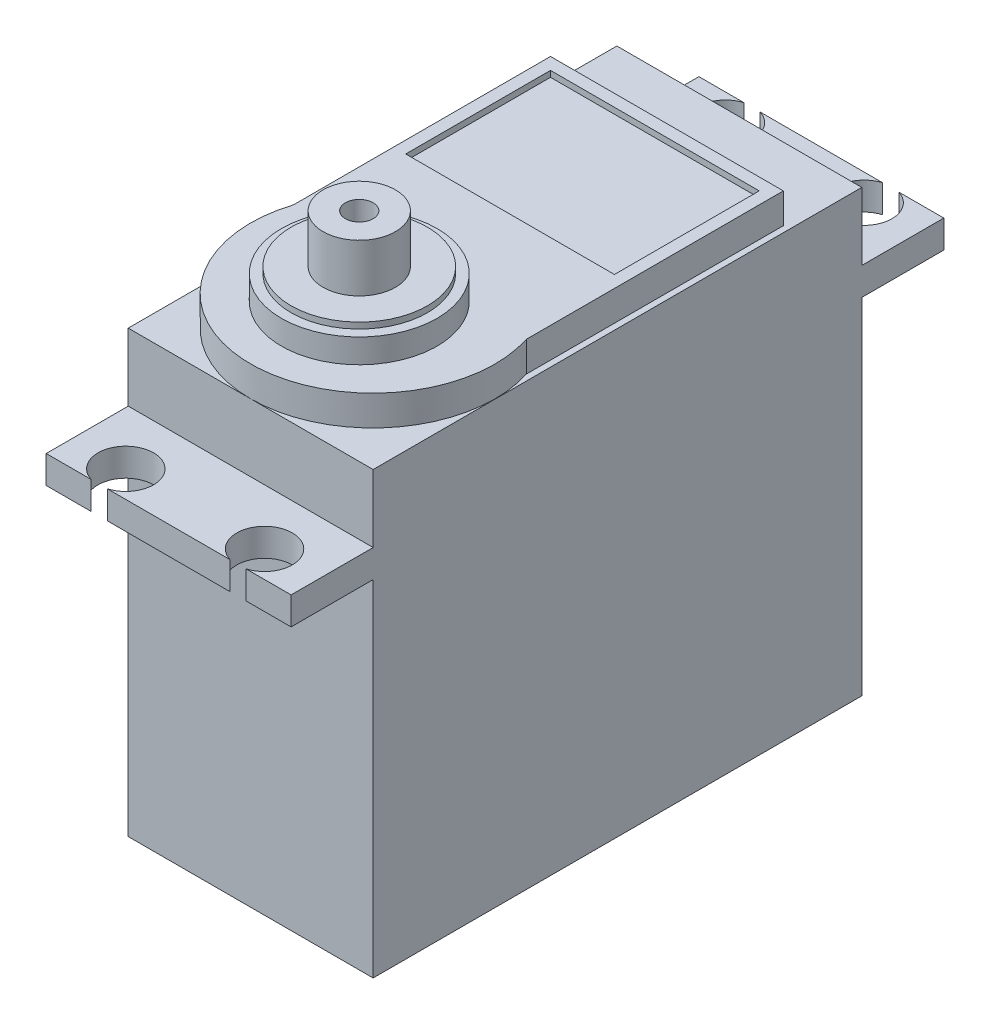
ISO-10303-21;
HEADER;
FILE_DESCRIPTION(('STEP AP214'),'2;1');
FILE_NAME('part.step','',(''),(''),'','','');
FILE_SCHEMA(('AUTOMOTIVE_DESIGN { 1 0 10303 214 1 1 1 1 }'));
ENDSEC;
DATA;
#1=APPLICATION_CONTEXT('core data for automotive mechanical design processes');
#2=APPLICATION_PROTOCOL_DEFINITION('international standard','automotive_design',2000,#1);
#3=PRODUCT_CONTEXT('',#1,'mechanical');
#4=PRODUCT('Part','Part','',(#3));
#5=PRODUCT_RELATED_PRODUCT_CATEGORY('part','',(#4));
#6=PRODUCT_DEFINITION_FORMATION('','',#4);
#7=PRODUCT_DEFINITION_CONTEXT('part definition',#1,'design');
#8=PRODUCT_DEFINITION('design','',#6,#7);
#9=PRODUCT_DEFINITION_SHAPE('','',#8);
#10=(LENGTH_UNIT() NAMED_UNIT(*) SI_UNIT(.MILLI.,.METRE.));
#11=(NAMED_UNIT(*) PLANE_ANGLE_UNIT() SI_UNIT($,.RADIAN.));
#12=(NAMED_UNIT(*) SI_UNIT($,.STERADIAN.) SOLID_ANGLE_UNIT());
#13=UNCERTAINTY_MEASURE_WITH_UNIT(LENGTH_MEASURE(1.E-05),#10,'distance_accuracy_value','');
#14=(GEOMETRIC_REPRESENTATION_CONTEXT(3) GLOBAL_UNCERTAINTY_ASSIGNED_CONTEXT((#13)) GLOBAL_UNIT_ASSIGNED_CONTEXT((#10,
#11,#12)) REPRESENTATION_CONTEXT('',''));
#15=CARTESIAN_POINT('',(0.,0.,0.));
#16=DIRECTION('',(0.,0.,1.));
#17=DIRECTION('',(1.,0.,0.));
#18=AXIS2_PLACEMENT_3D('',#15,#16,#17);
#19=CARTESIAN_POINT('',(-10.15,30.9,-27.05));
#20=DIRECTION('',(0.,-1.,0.));
#21=DIRECTION('',(0.,0.,-1.));
#22=AXIS2_PLACEMENT_3D('',#19,#20,#21);
#23=PLANE('',#22);
#24=DIRECTION('',(1.,0.,0.));
#25=VECTOR('',#24,1.);
#26=CARTESIAN_POINT('',(-10.15,30.9,-27.05));
#27=LINE('',#26,#25);
#28=CARTESIAN_POINT('',(-5.07917960675002,30.9,-27.05));
#29=VERTEX_POINT('',#28);
#30=CARTESIAN_POINT('',(5.07917960675007,30.9,-27.05));
#31=VERTEX_POINT('',#30);
#32=EDGE_CURVE('E348',#29,#31,#27,.T.);
#33=ORIENTED_EDGE('',*,*,#32,.F.);
#34=CARTESIAN_POINT('',(-5.74999999999999,30.9,-24.85));
#35=DIRECTION('',(0.,-1.,0.));
#36=DIRECTION('',(0.,0.,-1.));
#37=AXIS2_PLACEMENT_3D('',#34,#35,#36);
#38=CIRCLE('',#37,2.3);
#39=CARTESIAN_POINT('',(-6.42082039324996,30.9,-27.05));
#40=VERTEX_POINT('',#39);
#41=EDGE_CURVE('E312',#40,#29,#38,.F.);
#42=ORIENTED_EDGE('',*,*,#41,.F.);
#43=CARTESIAN_POINT('',(-10.15,30.9,-27.05));
#44=VERTEX_POINT('',#43);
#45=EDGE_CURVE('E344',#44,#40,#27,.T.);
#46=ORIENTED_EDGE('',*,*,#45,.F.);
#47=DIRECTION('',(0.,0.,1.));
#48=VECTOR('',#47,1.);
#49=CARTESIAN_POINT('',(-10.15,30.9,-27.05));
#50=LINE('',#49,#48);
#51=CARTESIAN_POINT('',(-10.15,30.9,-20.25));
#52=VERTEX_POINT('',#51);
#53=EDGE_CURVE('E353',#44,#52,#50,.T.);
#54=ORIENTED_EDGE('',*,*,#53,.T.);
#55=DIRECTION('',(1.,0.,0.));
#56=VECTOR('',#55,1.);
#57=CARTESIAN_POINT('',(-10.15,30.9,-20.25));
#58=LINE('',#57,#56);
#59=CARTESIAN_POINT('',(10.15,30.9,-20.25));
#60=VERTEX_POINT('',#59);
#61=EDGE_CURVE('E336',#52,#60,#58,.T.);
#62=ORIENTED_EDGE('',*,*,#61,.T.);
#63=DIRECTION('',(0.,0.,1.));
#64=VECTOR('',#63,1.);
#65=CARTESIAN_POINT('',(10.15,30.9,-27.05));
#66=LINE('',#65,#64);
#67=CARTESIAN_POINT('',(10.15,30.9,-27.05));
#68=VERTEX_POINT('',#67);
#69=EDGE_CURVE('E357',#68,#60,#66,.T.);
#70=ORIENTED_EDGE('',*,*,#69,.F.);
#71=CARTESIAN_POINT('',(6.42082039324993,30.9,-27.05));
#72=VERTEX_POINT('',#71);
#73=EDGE_CURVE('E343',#72,#68,#27,.T.);
#74=ORIENTED_EDGE('',*,*,#73,.F.);
#75=CARTESIAN_POINT('',(5.75,30.9,-24.85));
#76=DIRECTION('',(0.,-1.,0.));
#77=DIRECTION('',(0.,0.,-1.));
#78=AXIS2_PLACEMENT_3D('',#75,#76,#77);
#79=CIRCLE('',#78,2.3);
#80=EDGE_CURVE('E319',#72,#31,#79,.T.);
#81=ORIENTED_EDGE('',*,*,#80,.T.);
#82=EDGE_LOOP('',(#33,#42,#46,#54,#62,#70,#74,#81));
#83=FACE_BOUND('',#82,.T.);
#84=ADVANCED_FACE('F35',(#83),#23,.F.);
#85=CARTESIAN_POINT('',(10.15,28.6,-27.05));
#86=DIRECTION('',(0.,1.,0.));
#87=DIRECTION('',(0.,0.,1.));
#88=AXIS2_PLACEMENT_3D('',#85,#86,#87);
#89=PLANE('',#88);
#90=DIRECTION('',(-1.,0.,0.));
#91=VECTOR('',#90,1.);
#92=CARTESIAN_POINT('',(10.15,28.6,-27.05));
#93=LINE('',#92,#91);
#94=CARTESIAN_POINT('',(-6.42082039324996,28.6,-27.05));
#95=VERTEX_POINT('',#94);
#96=CARTESIAN_POINT('',(-10.15,28.6,-27.05));
#97=VERTEX_POINT('',#96);
#98=EDGE_CURVE('E335',#95,#97,#93,.T.);
#99=ORIENTED_EDGE('',*,*,#98,.F.);
#100=CARTESIAN_POINT('',(-5.74999999999999,28.6,-24.85));
#101=DIRECTION('',(0.,1.,0.));
#102=DIRECTION('',(0.,0.,1.));
#103=AXIS2_PLACEMENT_3D('',#100,#101,#102);
#104=CIRCLE('',#103,2.3);
#105=CARTESIAN_POINT('',(-5.07917960675002,28.6,-27.05));
#106=VERTEX_POINT('',#105);
#107=EDGE_CURVE('E316',#106,#95,#104,.F.);
#108=ORIENTED_EDGE('',*,*,#107,.F.);
#109=CARTESIAN_POINT('',(5.07917960675007,28.6,-27.05));
#110=VERTEX_POINT('',#109);
#111=EDGE_CURVE('E341',#110,#106,#93,.T.);
#112=ORIENTED_EDGE('',*,*,#111,.F.);
#113=CARTESIAN_POINT('',(5.75,28.6,-24.85));
#114=DIRECTION('',(0.,1.,0.));
#115=DIRECTION('',(0.,0.,1.));
#116=AXIS2_PLACEMENT_3D('',#113,#114,#115);
#117=CIRCLE('',#116,2.3);
#118=CARTESIAN_POINT('',(6.42082039324993,28.6,-27.05));
#119=VERTEX_POINT('',#118);
#120=EDGE_CURVE('E304',#110,#119,#117,.T.);
#121=ORIENTED_EDGE('',*,*,#120,.T.);
#122=CARTESIAN_POINT('',(10.15,28.6,-27.05));
#123=VERTEX_POINT('',#122);
#124=EDGE_CURVE('E337',#123,#119,#93,.T.);
#125=ORIENTED_EDGE('',*,*,#124,.F.);
#126=DIRECTION('',(0.,0.,1.));
#127=VECTOR('',#126,1.);
#128=CARTESIAN_POINT('',(10.15,28.6,-27.05));
#129=LINE('',#128,#127);
#130=CARTESIAN_POINT('',(10.15,28.6,-20.25));
#131=VERTEX_POINT('',#130);
#132=EDGE_CURVE('E360',#123,#131,#129,.T.);
#133=ORIENTED_EDGE('',*,*,#132,.T.);
#134=DIRECTION('',(-1.,0.,0.));
#135=VECTOR('',#134,1.);
#136=CARTESIAN_POINT('',(10.15,28.6,-20.25));
#137=LINE('',#136,#135);
#138=CARTESIAN_POINT('',(-10.15,28.6,-20.25));
#139=VERTEX_POINT('',#138);
#140=EDGE_CURVE('E314',#131,#139,#137,.T.);
#141=ORIENTED_EDGE('',*,*,#140,.T.);
#142=DIRECTION('',(0.,0.,1.));
#143=VECTOR('',#142,1.);
#144=CARTESIAN_POINT('',(-10.15,28.6,-27.05));
#145=LINE('',#144,#143);
#146=EDGE_CURVE('E347',#97,#139,#145,.T.);
#147=ORIENTED_EDGE('',*,*,#146,.F.);
#148=EDGE_LOOP('',(#99,#108,#112,#121,#125,#133,#141,#147));
#149=FACE_BOUND('',#148,.T.);
#150=ADVANCED_FACE('F475',(#149),#89,.F.);
#151=CARTESIAN_POINT('',(0.,0.,-27.05));
#152=DIRECTION('',(0.,0.,1.));
#153=DIRECTION('',(-1.,0.,0.));
#154=AXIS2_PLACEMENT_3D('',#151,#152,#153);
#155=PLANE('',#154);
#156=ORIENTED_EDGE('',*,*,#111,.T.);
#157=DIRECTION('',(0.,1.,0.));
#158=VECTOR('',#157,1.);
#159=CARTESIAN_POINT('',(-5.07917960675002,-0.00199999999999853,-27.05));
#160=LINE('',#159,#158);
#161=EDGE_CURVE('E318',#106,#29,#160,.T.);
#162=ORIENTED_EDGE('',*,*,#161,.T.);
#163=ORIENTED_EDGE('',*,*,#32,.T.);
#164=DIRECTION('',(0.,1.,0.));
#165=VECTOR('',#164,1.);
#166=CARTESIAN_POINT('',(5.07917960675007,-0.00199999999999853,-27.05));
#167=LINE('',#166,#165);
#168=EDGE_CURVE('E328',#110,#31,#167,.T.);
#169=ORIENTED_EDGE('',*,*,#168,.F.);
#170=EDGE_LOOP('',(#156,#162,#163,#169));
#171=FACE_BOUND('',#170,.T.);
#172=ADVANCED_FACE('F540',(#171),#155,.F.);
#173=DIRECTION('',(0.,1.,0.));
#174=VECTOR('',#173,1.);
#175=CARTESIAN_POINT('',(6.42082039324993,-0.00199999999999853,-27.05));
#176=LINE('',#175,#174);
#177=EDGE_CURVE('E325',#119,#72,#176,.T.);
#178=ORIENTED_EDGE('',*,*,#177,.T.);
#179=ORIENTED_EDGE('',*,*,#73,.T.);
#180=DIRECTION('',(0.,-1.,0.));
#181=VECTOR('',#180,1.);
#182=CARTESIAN_POINT('',(10.15,30.9,-27.05));
#183=LINE('',#182,#181);
#184=EDGE_CURVE('E340',#68,#123,#183,.T.);
#185=ORIENTED_EDGE('',*,*,#184,.T.);
#186=ORIENTED_EDGE('',*,*,#124,.T.);
#187=EDGE_LOOP('',(#178,#179,#185,#186));
#188=FACE_BOUND('',#187,.T.);
#189=ADVANCED_FACE('F480',(#188),#155,.F.);
#190=ORIENTED_EDGE('',*,*,#45,.T.);
#191=DIRECTION('',(0.,1.,0.));
#192=VECTOR('',#191,1.);
#193=CARTESIAN_POINT('',(-6.42082039324996,-0.00199999999999853,-27.05));
#194=LINE('',#193,#192);
#195=EDGE_CURVE('E315',#95,#40,#194,.T.);
#196=ORIENTED_EDGE('',*,*,#195,.F.);
#197=ORIENTED_EDGE('',*,*,#98,.T.);
#198=DIRECTION('',(0.,1.,0.));
#199=VECTOR('',#198,1.);
#200=CARTESIAN_POINT('',(-10.15,28.6,-27.05));
#201=LINE('',#200,#199);
#202=EDGE_CURVE('E332',#97,#44,#201,.T.);
#203=ORIENTED_EDGE('',*,*,#202,.T.);
#204=EDGE_LOOP('',(#190,#196,#197,#203));
#205=FACE_BOUND('',#204,.T.);
#206=ADVANCED_FACE('F800',(#205),#155,.F.);
#207=CARTESIAN_POINT('',(-10.15,36.5,-20.25));
#208=DIRECTION('',(0.,0.,1.));
#209=DIRECTION('',(1.,0.,0.));
#210=AXIS2_PLACEMENT_3D('',#207,#208,#209);
#211=PLANE('',#210);
#212=ORIENTED_EDGE('',*,*,#140,.F.);
#213=DIRECTION('',(0.,-1.,0.));
#214=VECTOR('',#213,1.);
#215=CARTESIAN_POINT('',(10.15,36.5,-20.25));
#216=LINE('',#215,#214);
#217=CARTESIAN_POINT('',(10.15,0.,-20.25));
#218=VERTEX_POINT('',#217);
#219=EDGE_CURVE('E448',#131,#218,#216,.T.);
#220=ORIENTED_EDGE('',*,*,#219,.T.);
#221=DIRECTION('',(-1.,0.,0.));
#222=VECTOR('',#221,1.);
#223=CARTESIAN_POINT('',(-10.15,0.,-20.25));
#224=LINE('',#223,#222);
#225=CARTESIAN_POINT('',(-10.15,0.,-20.25));
#226=VERTEX_POINT('',#225);
#227=EDGE_CURVE('E430',#218,#226,#224,.T.);
#228=ORIENTED_EDGE('',*,*,#227,.T.);
#229=DIRECTION('',(0.,-1.,0.));
#230=VECTOR('',#229,1.);
#231=CARTESIAN_POINT('',(-10.15,36.5,-20.25));
#232=LINE('',#231,#230);
#233=EDGE_CURVE('E445',#139,#226,#232,.T.);
#234=ORIENTED_EDGE('',*,*,#233,.F.);
#235=EDGE_LOOP('',(#212,#220,#228,#234));
#236=FACE_BOUND('',#235,.T.);
#237=ADVANCED_FACE('F455',(#236),#211,.F.);
#238=ORIENTED_EDGE('',*,*,#61,.F.);
#239=CARTESIAN_POINT('',(-10.15,36.5,-20.25));
#240=VERTEX_POINT('',#239);
#241=EDGE_CURVE('E446',#240,#52,#232,.T.);
#242=ORIENTED_EDGE('',*,*,#241,.F.);
#243=DIRECTION('',(-1.,0.,0.));
#244=VECTOR('',#243,1.);
#245=CARTESIAN_POINT('',(-10.15,36.5,-20.25));
#246=LINE('',#245,#244);
#247=CARTESIAN_POINT('',(10.15,36.5,-20.25));
#248=VERTEX_POINT('',#247);
#249=EDGE_CURVE('E418',#248,#240,#246,.T.);
#250=ORIENTED_EDGE('',*,*,#249,.F.);
#251=EDGE_CURVE('E449',#248,#60,#216,.T.);
#252=ORIENTED_EDGE('',*,*,#251,.T.);
#253=EDGE_LOOP('',(#238,#242,#250,#252));
#254=FACE_BOUND('',#253,.T.);
#255=ADVANCED_FACE('F486',(#254),#211,.F.);
#256=CARTESIAN_POINT('',(10.15,28.6,27.05));
#257=DIRECTION('',(0.,-1.,0.));
#258=DIRECTION('',(0.,0.,-1.));
#259=AXIS2_PLACEMENT_3D('',#256,#257,#258);
#260=PLANE('',#259);
#261=DIRECTION('',(-1.,0.,0.));
#262=VECTOR('',#261,1.);
#263=CARTESIAN_POINT('',(10.15,28.6,27.05));
#264=LINE('',#263,#262);
#265=CARTESIAN_POINT('',(5.07917960675007,28.6,27.05));
#266=VERTEX_POINT('',#265);
#267=CARTESIAN_POINT('',(-5.07917960675003,28.6,27.05));
#268=VERTEX_POINT('',#267);
#269=EDGE_CURVE('E402',#266,#268,#264,.T.);
#270=ORIENTED_EDGE('',*,*,#269,.T.);
#271=CARTESIAN_POINT('',(-5.74999999999999,28.6,24.85));
#272=DIRECTION('',(0.,-1.,0.));
#273=DIRECTION('',(0.,0.,-1.));
#274=AXIS2_PLACEMENT_3D('',#271,#272,#273);
#275=CIRCLE('',#274,2.3);
#276=CARTESIAN_POINT('',(-6.42082039324996,28.6,27.05));
#277=VERTEX_POINT('',#276);
#278=EDGE_CURVE('E370',#277,#268,#275,.T.);
#279=ORIENTED_EDGE('',*,*,#278,.F.);
#280=CARTESIAN_POINT('',(-10.15,28.6,27.05));
#281=VERTEX_POINT('',#280);
#282=EDGE_CURVE('E397',#277,#281,#264,.T.);
#283=ORIENTED_EDGE('',*,*,#282,.T.);
#284=DIRECTION('',(0.,0.,-1.));
#285=VECTOR('',#284,1.);
#286=CARTESIAN_POINT('',(-10.15,28.6,27.05));
#287=LINE('',#286,#285);
#288=CARTESIAN_POINT('',(-10.15,28.6,20.25));
#289=VERTEX_POINT('',#288);
#290=EDGE_CURVE('E407',#281,#289,#287,.T.);
#291=ORIENTED_EDGE('',*,*,#290,.T.);
#292=DIRECTION('',(-1.,0.,0.));
#293=VECTOR('',#292,1.);
#294=CARTESIAN_POINT('',(10.15,28.6,20.25));
#295=LINE('',#294,#293);
#296=CARTESIAN_POINT('',(10.15,28.6,20.25));
#297=VERTEX_POINT('',#296);
#298=EDGE_CURVE('E389',#297,#289,#295,.T.);
#299=ORIENTED_EDGE('',*,*,#298,.F.);
#300=DIRECTION('',(0.,0.,-1.));
#301=VECTOR('',#300,1.);
#302=CARTESIAN_POINT('',(10.15,28.6,27.05));
#303=LINE('',#302,#301);
#304=CARTESIAN_POINT('',(10.15,28.6,27.05));
#305=VERTEX_POINT('',#304);
#306=EDGE_CURVE('E410',#305,#297,#303,.T.);
#307=ORIENTED_EDGE('',*,*,#306,.F.);
#308=CARTESIAN_POINT('',(6.42082039324993,28.6,27.05));
#309=VERTEX_POINT('',#308);
#310=EDGE_CURVE('E398',#305,#309,#264,.T.);
#311=ORIENTED_EDGE('',*,*,#310,.T.);
#312=CARTESIAN_POINT('',(5.75,28.6,24.85));
#313=DIRECTION('',(0.,-1.,0.));
#314=DIRECTION('',(0.,0.,-1.));
#315=AXIS2_PLACEMENT_3D('',#312,#313,#314);
#316=CIRCLE('',#315,2.3);
#317=EDGE_CURVE('E356',#309,#266,#316,.F.);
#318=ORIENTED_EDGE('',*,*,#317,.T.);
#319=EDGE_LOOP('',(#270,#279,#283,#291,#299,#307,#311,#318));
#320=FACE_BOUND('',#319,.T.);
#321=ADVANCED_FACE('F517',(#320),#260,.T.);
#322=CARTESIAN_POINT('',(-10.15,30.9,27.05));
#323=DIRECTION('',(0.,1.,0.));
#324=DIRECTION('',(0.,0.,1.));
#325=AXIS2_PLACEMENT_3D('',#322,#323,#324);
#326=PLANE('',#325);
#327=DIRECTION('',(1.,0.,0.));
#328=VECTOR('',#327,1.);
#329=CARTESIAN_POINT('',(-10.15,30.9,27.05));
#330=LINE('',#329,#328);
#331=CARTESIAN_POINT('',(-10.15,30.9,27.05));
#332=VERTEX_POINT('',#331);
#333=CARTESIAN_POINT('',(-6.42082039324996,30.9,27.05));
#334=VERTEX_POINT('',#333);
#335=EDGE_CURVE('E390',#332,#334,#330,.T.);
#336=ORIENTED_EDGE('',*,*,#335,.T.);
#337=CARTESIAN_POINT('',(-5.74999999999999,30.9,24.85));
#338=DIRECTION('',(0.,1.,0.));
#339=DIRECTION('',(0.,0.,1.));
#340=AXIS2_PLACEMENT_3D('',#337,#338,#339);
#341=CIRCLE('',#340,2.3);
#342=CARTESIAN_POINT('',(-5.07917960675002,30.9,27.05));
#343=VERTEX_POINT('',#342);
#344=EDGE_CURVE('E365',#334,#343,#341,.F.);
#345=ORIENTED_EDGE('',*,*,#344,.T.);
#346=CARTESIAN_POINT('',(5.07917960675007,30.9,27.05));
#347=VERTEX_POINT('',#346);
#348=EDGE_CURVE('E394',#343,#347,#330,.T.);
#349=ORIENTED_EDGE('',*,*,#348,.T.);
#350=CARTESIAN_POINT('',(5.75,30.9,24.85));
#351=DIRECTION('',(0.,1.,0.));
#352=DIRECTION('',(0.,0.,1.));
#353=AXIS2_PLACEMENT_3D('',#350,#351,#352);
#354=CIRCLE('',#353,2.3);
#355=CARTESIAN_POINT('',(6.42082039324993,30.9,27.05));
#356=VERTEX_POINT('',#355);
#357=EDGE_CURVE('E373',#356,#347,#354,.T.);
#358=ORIENTED_EDGE('',*,*,#357,.F.);
#359=CARTESIAN_POINT('',(10.15,30.9,27.05));
#360=VERTEX_POINT('',#359);
#361=EDGE_CURVE('E388',#356,#360,#330,.T.);
#362=ORIENTED_EDGE('',*,*,#361,.T.);
#363=DIRECTION('',(0.,0.,-1.));
#364=VECTOR('',#363,1.);
#365=CARTESIAN_POINT('',(10.15,30.9,27.05));
#366=LINE('',#365,#364);
#367=CARTESIAN_POINT('',(10.15,30.9,20.25));
#368=VERTEX_POINT('',#367);
#369=EDGE_CURVE('E412',#360,#368,#366,.T.);
#370=ORIENTED_EDGE('',*,*,#369,.T.);
#371=DIRECTION('',(1.,0.,0.));
#372=VECTOR('',#371,1.);
#373=CARTESIAN_POINT('',(-10.15,30.9,20.25));
#374=LINE('',#373,#372);
#375=CARTESIAN_POINT('',(-10.15,30.9,20.25));
#376=VERTEX_POINT('',#375);
#377=EDGE_CURVE('E368',#376,#368,#374,.T.);
#378=ORIENTED_EDGE('',*,*,#377,.F.);
#379=DIRECTION('',(0.,0.,-1.));
#380=VECTOR('',#379,1.);
#381=CARTESIAN_POINT('',(-10.15,30.9,27.05));
#382=LINE('',#381,#380);
#383=EDGE_CURVE('E401',#332,#376,#382,.T.);
#384=ORIENTED_EDGE('',*,*,#383,.F.);
#385=EDGE_LOOP('',(#336,#345,#349,#358,#362,#370,#378,#384));
#386=FACE_BOUND('',#385,.T.);
#387=ADVANCED_FACE('F501',(#386),#326,.T.);
#388=CARTESIAN_POINT('',(0.,0.,27.05));
#389=DIRECTION('',(0.,0.,-1.));
#390=DIRECTION('',(-1.,0.,0.));
#391=AXIS2_PLACEMENT_3D('',#388,#389,#390);
#392=PLANE('',#391);
#393=DIRECTION('',(0.,1.,0.));
#394=VECTOR('',#393,1.);
#395=CARTESIAN_POINT('',(-6.42082039324996,-0.00199999999999853,27.05));
#396=LINE('',#395,#394);
#397=EDGE_CURVE('E372',#277,#334,#396,.T.);
#398=ORIENTED_EDGE('',*,*,#397,.T.);
#399=ORIENTED_EDGE('',*,*,#335,.F.);
#400=DIRECTION('',(0.,1.,0.));
#401=VECTOR('',#400,1.);
#402=CARTESIAN_POINT('',(-10.15,28.6,27.05));
#403=LINE('',#402,#401);
#404=EDGE_CURVE('E385',#281,#332,#403,.T.);
#405=ORIENTED_EDGE('',*,*,#404,.F.);
#406=ORIENTED_EDGE('',*,*,#282,.F.);
#407=EDGE_LOOP('',(#398,#399,#405,#406));
#408=FACE_BOUND('',#407,.T.);
#409=ADVANCED_FACE('F523',(#408),#392,.F.);
#410=DIRECTION('',(0.,1.,0.));
#411=VECTOR('',#410,1.);
#412=CARTESIAN_POINT('',(-5.07917960675002,-0.00199999999999853,27.05));
#413=LINE('',#412,#411);
#414=EDGE_CURVE('E369',#268,#343,#413,.T.);
#415=ORIENTED_EDGE('',*,*,#414,.F.);
#416=ORIENTED_EDGE('',*,*,#269,.F.);
#417=DIRECTION('',(0.,1.,0.));
#418=VECTOR('',#417,1.);
#419=CARTESIAN_POINT('',(5.07917960675007,-0.00199999999999853,27.05));
#420=LINE('',#419,#418);
#421=EDGE_CURVE('E378',#266,#347,#420,.T.);
#422=ORIENTED_EDGE('',*,*,#421,.T.);
#423=ORIENTED_EDGE('',*,*,#348,.F.);
#424=EDGE_LOOP('',(#415,#416,#422,#423));
#425=FACE_BOUND('',#424,.T.);
#426=ADVANCED_FACE('F511',(#425),#392,.F.);
#427=CARTESIAN_POINT('',(-10.15,36.5,20.25));
#428=DIRECTION('',(0.,0.,-1.));
#429=DIRECTION('',(-1.,0.,0.));
#430=AXIS2_PLACEMENT_3D('',#427,#428,#429);
#431=PLANE('',#430);
#432=DIRECTION('',(0.,-1.,0.));
#433=VECTOR('',#432,1.);
#434=CARTESIAN_POINT('',(-10.15,36.5,20.25));
#435=LINE('',#434,#433);
#436=CARTESIAN_POINT('',(-10.15,36.5,20.25));
#437=VERTEX_POINT('',#436);
#438=EDGE_CURVE('E442',#437,#376,#435,.T.);
#439=ORIENTED_EDGE('',*,*,#438,.T.);
#440=ORIENTED_EDGE('',*,*,#377,.T.);
#441=DIRECTION('',(0.,-1.,0.));
#442=VECTOR('',#441,1.);
#443=CARTESIAN_POINT('',(10.15,36.5,20.25));
#444=LINE('',#443,#442);
#445=CARTESIAN_POINT('',(10.15,36.5,20.25));
#446=VERTEX_POINT('',#445);
#447=EDGE_CURVE('E438',#446,#368,#444,.T.);
#448=ORIENTED_EDGE('',*,*,#447,.F.);
#449=DIRECTION('',(1.,0.,0.));
#450=VECTOR('',#449,1.);
#451=CARTESIAN_POINT('',(-10.15,36.5,20.25));
#452=LINE('',#451,#450);
#453=CARTESIAN_POINT('',(0.,36.5,20.25));
#454=VERTEX_POINT('',#453);
#455=EDGE_CURVE('E423',#454,#446,#452,.T.);
#456=ORIENTED_EDGE('',*,*,#455,.F.);
#457=EDGE_CURVE('E424',#437,#454,#452,.T.);
#458=ORIENTED_EDGE('',*,*,#457,.F.);
#459=EDGE_LOOP('',(#439,#440,#448,#456,#458));
#460=FACE_BOUND('',#459,.T.);
#461=ADVANCED_FACE('F498',(#460),#431,.F.);
#462=CARTESIAN_POINT('',(10.15,36.5,20.25));
#463=DIRECTION('',(-1.,0.,0.));
#464=DIRECTION('',(0.,0.,1.));
#465=AXIS2_PLACEMENT_3D('',#462,#463,#464);
#466=PLANE('',#465);
#467=DIRECTION('',(0.,0.,-1.));
#468=VECTOR('',#467,1.);
#469=CARTESIAN_POINT('',(10.15,0.,20.25));
#470=LINE('',#469,#468);
#471=CARTESIAN_POINT('',(10.15,0.,20.25));
#472=VERTEX_POINT('',#471);
#473=EDGE_CURVE('E409',#472,#218,#470,.T.);
#474=ORIENTED_EDGE('',*,*,#473,.T.);
#475=ORIENTED_EDGE('',*,*,#219,.F.);
#476=ORIENTED_EDGE('',*,*,#132,.F.);
#477=ORIENTED_EDGE('',*,*,#184,.F.);
#478=ORIENTED_EDGE('',*,*,#69,.T.);
#479=ORIENTED_EDGE('',*,*,#251,.F.);
#480=DIRECTION('',(0.,0.,-1.));
#481=VECTOR('',#480,1.);
#482=CARTESIAN_POINT('',(10.15,36.5,20.25));
#483=LINE('',#482,#481);
#484=EDGE_CURVE('E415',#446,#248,#483,.T.);
#485=ORIENTED_EDGE('',*,*,#484,.F.);
#486=ORIENTED_EDGE('',*,*,#447,.T.);
#487=ORIENTED_EDGE('',*,*,#369,.F.);
#488=DIRECTION('',(0.,-1.,0.));
#489=VECTOR('',#488,1.);
#490=CARTESIAN_POINT('',(10.15,30.9,27.05));
#491=LINE('',#490,#489);
#492=EDGE_CURVE('E393',#360,#305,#491,.T.);
#493=ORIENTED_EDGE('',*,*,#492,.T.);
#494=ORIENTED_EDGE('',*,*,#306,.T.);
#495=EDGE_CURVE('E427',#297,#472,#444,.T.);
#496=ORIENTED_EDGE('',*,*,#495,.T.);
#497=EDGE_LOOP('',(#474,#475,#476,#477,#478,#479,#485,#486,#487,#493,#494,#496));
#498=FACE_BOUND('',#497,.T.);
#499=ADVANCED_FACE('F37',(#498),#466,.F.);
#500=CARTESIAN_POINT('',(-10.15,36.5,20.25));
#501=DIRECTION('',(1.,0.,0.));
#502=DIRECTION('',(0.,0.,-1.));
#503=AXIS2_PLACEMENT_3D('',#500,#501,#502);
#504=PLANE('',#503);
#505=DIRECTION('',(0.,0.,1.));
#506=VECTOR('',#505,1.);
#507=CARTESIAN_POINT('',(-10.15,0.,20.25));
#508=LINE('',#507,#506);
#509=CARTESIAN_POINT('',(-10.15,0.,20.25));
#510=VERTEX_POINT('',#509);
#511=EDGE_CURVE('E433',#226,#510,#508,.T.);
#512=ORIENTED_EDGE('',*,*,#511,.T.);
#513=EDGE_CURVE('E441',#289,#510,#435,.T.);
#514=ORIENTED_EDGE('',*,*,#513,.F.);
#515=ORIENTED_EDGE('',*,*,#290,.F.);
#516=ORIENTED_EDGE('',*,*,#404,.T.);
#517=ORIENTED_EDGE('',*,*,#383,.T.);
#518=ORIENTED_EDGE('',*,*,#438,.F.);
#519=DIRECTION('',(0.,0.,1.));
#520=VECTOR('',#519,1.);
#521=CARTESIAN_POINT('',(-10.15,36.5,20.25));
#522=LINE('',#521,#520);
#523=EDGE_CURVE('E421',#240,#437,#522,.T.);
#524=ORIENTED_EDGE('',*,*,#523,.F.);
#525=ORIENTED_EDGE('',*,*,#241,.T.);
#526=ORIENTED_EDGE('',*,*,#53,.F.);
#527=ORIENTED_EDGE('',*,*,#202,.F.);
#528=ORIENTED_EDGE('',*,*,#146,.T.);
#529=ORIENTED_EDGE('',*,*,#233,.T.);
#530=EDGE_LOOP('',(#512,#514,#515,#516,#517,#518,#524,#525,#526,#527,#528,#529));
#531=FACE_BOUND('',#530,.T.);
#532=ADVANCED_FACE('F470',(#531),#504,.F.);
#533=ORIENTED_EDGE('',*,*,#495,.F.);
#534=ORIENTED_EDGE('',*,*,#298,.T.);
#535=ORIENTED_EDGE('',*,*,#513,.T.);
#536=DIRECTION('',(1.,0.,0.));
#537=VECTOR('',#536,1.);
#538=CARTESIAN_POINT('',(-10.15,0.,20.25));
#539=LINE('',#538,#537);
#540=EDGE_CURVE('E419',#510,#472,#539,.T.);
#541=ORIENTED_EDGE('',*,*,#540,.T.);
#542=EDGE_LOOP('',(#533,#534,#535,#541));
#543=FACE_BOUND('',#542,.T.);
#544=ADVANCED_FACE('F466',(#543),#431,.F.);
#545=CARTESIAN_POINT('',(0.,36.5,0.));
#546=DIRECTION('',(0.,-1.,0.));
#547=DIRECTION('',(0.,0.,-1.));
#548=AXIS2_PLACEMENT_3D('',#545,#546,#547);
#549=PLANE('',#548);
#550=DIRECTION('',(-1.,0.,0.));
#551=VECTOR('',#550,1.);
#552=CARTESIAN_POINT('',(9.65,36.5,-14.25));
#553=LINE('',#552,#551);
#554=CARTESIAN_POINT('',(9.65,36.5,-14.25));
#555=VERTEX_POINT('',#554);
#556=CARTESIAN_POINT('',(-9.65,36.5,-14.25));
#557=VERTEX_POINT('',#556);
#558=EDGE_CURVE('E284',#555,#557,#553,.T.);
#559=ORIENTED_EDGE('',*,*,#558,.F.);
#560=DIRECTION('',(0.,0.,1.));
#561=VECTOR('',#560,1.);
#562=CARTESIAN_POINT('',(9.65,36.5,-14.25));
#563=LINE('',#562,#561);
#564=CARTESIAN_POINT('',(9.65,36.5,7.05));
#565=VERTEX_POINT('',#564);
#566=EDGE_CURVE('E60',#555,#565,#563,.T.);
#567=ORIENTED_EDGE('',*,*,#566,.T.);
#568=CARTESIAN_POINT('',(0.,36.5,10.1226325757576));
#569=DIRECTION('',(0.,-1.,0.));
#570=DIRECTION('',(0.,0.,-1.));
#571=AXIS2_PLACEMENT_3D('',#568,#569,#570);
#572=CIRCLE('',#571,10.1273674242424);
#573=EDGE_CURVE('E293',#565,#454,#572,.T.);
#574=ORIENTED_EDGE('',*,*,#573,.T.);
#575=ORIENTED_EDGE('',*,*,#455,.T.);
#576=ORIENTED_EDGE('',*,*,#484,.T.);
#577=ORIENTED_EDGE('',*,*,#249,.T.);
#578=ORIENTED_EDGE('',*,*,#523,.T.);
#579=ORIENTED_EDGE('',*,*,#457,.T.);
#580=CARTESIAN_POINT('',(-9.65,36.5,7.05));
#581=VERTEX_POINT('',#580);
#582=EDGE_CURVE('E296',#454,#581,#572,.T.);
#583=ORIENTED_EDGE('',*,*,#582,.T.);
#584=DIRECTION('',(0.,0.,1.));
#585=VECTOR('',#584,1.);
#586=CARTESIAN_POINT('',(-9.65,36.5,-14.25));
#587=LINE('',#586,#585);
#588=EDGE_CURVE('E295',#557,#581,#587,.T.);
#589=ORIENTED_EDGE('',*,*,#588,.F.);
#590=EDGE_LOOP('',(#559,#567,#574,#575,#576,#577,#578,#579,#583,#589));
#591=FACE_BOUND('',#590,.T.);
#592=ADVANCED_FACE('F490',(#591),#549,.F.);
#593=CARTESIAN_POINT('',(0.,0.,0.));
#594=DIRECTION('',(0.,-1.,0.));
#595=DIRECTION('',(0.,0.,-1.));
#596=AXIS2_PLACEMENT_3D('',#593,#594,#595);
#597=PLANE('',#596);
#598=ORIENTED_EDGE('',*,*,#473,.F.);
#599=ORIENTED_EDGE('',*,*,#540,.F.);
#600=ORIENTED_EDGE('',*,*,#511,.F.);
#601=ORIENTED_EDGE('',*,*,#227,.F.);
#602=EDGE_LOOP('',(#598,#599,#600,#601));
#603=FACE_BOUND('',#602,.T.);
#604=ADVANCED_FACE('F461',(#603),#597,.T.);
#605=ORIENTED_EDGE('',*,*,#361,.F.);
#606=DIRECTION('',(0.,1.,0.));
#607=VECTOR('',#606,1.);
#608=CARTESIAN_POINT('',(6.42082039324993,-0.00199999999999853,27.05));
#609=LINE('',#608,#607);
#610=EDGE_CURVE('E381',#309,#356,#609,.T.);
#611=ORIENTED_EDGE('',*,*,#610,.F.);
#612=ORIENTED_EDGE('',*,*,#310,.F.);
#613=ORIENTED_EDGE('',*,*,#492,.F.);
#614=EDGE_LOOP('',(#605,#611,#612,#613));
#615=FACE_BOUND('',#614,.T.);
#616=ADVANCED_FACE('F520',(#615),#392,.F.);
#617=CARTESIAN_POINT('',(5.75,-0.00199999999999853,24.85));
#618=DIRECTION('',(0.,1.,0.));
#619=DIRECTION('',(0.,0.,1.));
#620=AXIS2_PLACEMENT_3D('',#617,#618,#619);
#621=CYLINDRICAL_SURFACE('',#620,2.3);
#622=ORIENTED_EDGE('',*,*,#610,.T.);
#623=ORIENTED_EDGE('',*,*,#357,.T.);
#624=ORIENTED_EDGE('',*,*,#421,.F.);
#625=ORIENTED_EDGE('',*,*,#317,.F.);
#626=EDGE_LOOP('',(#622,#623,#624,#625));
#627=FACE_BOUND('',#626,.T.);
#628=ADVANCED_FACE('F515',(#627),#621,.F.);
#629=CARTESIAN_POINT('',(-5.74999999999999,-0.00199999999999853,24.85));
#630=DIRECTION('',(0.,1.,0.));
#631=DIRECTION('',(0.,0.,1.));
#632=AXIS2_PLACEMENT_3D('',#629,#630,#631);
#633=CYLINDRICAL_SURFACE('',#632,2.3);
#634=ORIENTED_EDGE('',*,*,#278,.T.);
#635=ORIENTED_EDGE('',*,*,#414,.T.);
#636=ORIENTED_EDGE('',*,*,#344,.F.);
#637=ORIENTED_EDGE('',*,*,#397,.F.);
#638=EDGE_LOOP('',(#634,#635,#636,#637));
#639=FACE_BOUND('',#638,.T.);
#640=ADVANCED_FACE('F528',(#639),#633,.F.);
#641=CARTESIAN_POINT('',(5.75,-0.00199999999999853,-24.85));
#642=DIRECTION('',(0.,1.,0.));
#643=DIRECTION('',(0.,0.,1.));
#644=AXIS2_PLACEMENT_3D('',#641,#642,#643);
#645=CYLINDRICAL_SURFACE('',#644,2.3);
#646=ORIENTED_EDGE('',*,*,#168,.T.);
#647=ORIENTED_EDGE('',*,*,#80,.F.);
#648=ORIENTED_EDGE('',*,*,#177,.F.);
#649=ORIENTED_EDGE('',*,*,#120,.F.);
#650=EDGE_LOOP('',(#646,#647,#648,#649));
#651=FACE_BOUND('',#650,.T.);
#652=ADVANCED_FACE('F546',(#651),#645,.F.);
#653=CARTESIAN_POINT('',(-5.74999999999999,-0.00199999999999853,-24.85));
#654=DIRECTION('',(0.,1.,0.));
#655=DIRECTION('',(0.,0.,1.));
#656=AXIS2_PLACEMENT_3D('',#653,#654,#655);
#657=CYLINDRICAL_SURFACE('',#656,2.3);
#658=ORIENTED_EDGE('',*,*,#107,.T.);
#659=ORIENTED_EDGE('',*,*,#195,.T.);
#660=ORIENTED_EDGE('',*,*,#41,.T.);
#661=ORIENTED_EDGE('',*,*,#161,.F.);
#662=EDGE_LOOP('',(#658,#659,#660,#661));
#663=FACE_BOUND('',#662,.T.);
#664=ADVANCED_FACE('F551',(#663),#657,.F.);
#665=CARTESIAN_POINT('',(9.65,39.,-14.25));
#666=DIRECTION('',(1.,0.,0.));
#667=DIRECTION('',(0.,0.,-1.));
#668=AXIS2_PLACEMENT_3D('',#665,#666,#667);
#669=PLANE('',#668);
#670=ORIENTED_EDGE('',*,*,#566,.F.);
#671=DIRECTION('',(0.,-1.,0.));
#672=VECTOR('',#671,1.);
#673=CARTESIAN_POINT('',(9.65,39.,-14.25));
#674=LINE('',#673,#672);
#675=CARTESIAN_POINT('',(9.65,39.,-14.25));
#676=VERTEX_POINT('',#675);
#677=EDGE_CURVE('E301',#676,#555,#674,.T.);
#678=ORIENTED_EDGE('',*,*,#677,.F.);
#679=DIRECTION('',(0.,0.,1.));
#680=VECTOR('',#679,1.);
#681=CARTESIAN_POINT('',(9.65,39.,-14.25));
#682=LINE('',#681,#680);
#683=CARTESIAN_POINT('',(9.65,39.,7.05));
#684=VERTEX_POINT('',#683);
#685=EDGE_CURVE('E280',#676,#684,#682,.T.);
#686=ORIENTED_EDGE('',*,*,#685,.T.);
#687=DIRECTION('',(0.,-1.,0.));
#688=VECTOR('',#687,1.);
#689=CARTESIAN_POINT('',(9.65,39.,7.05));
#690=LINE('',#689,#688);
#691=EDGE_CURVE('E291',#684,#565,#690,.T.);
#692=ORIENTED_EDGE('',*,*,#691,.T.);
#693=EDGE_LOOP('',(#670,#678,#686,#692));
#694=FACE_BOUND('',#693,.T.);
#695=ADVANCED_FACE('F558',(#694),#669,.T.);
#696=CARTESIAN_POINT('',(9.65,39.,-14.25));
#697=DIRECTION('',(0.,0.,1.));
#698=DIRECTION('',(1.,0.,0.));
#699=AXIS2_PLACEMENT_3D('',#696,#697,#698);
#700=PLANE('',#699);
#701=ORIENTED_EDGE('',*,*,#558,.T.);
#702=DIRECTION('',(0.,-1.,0.));
#703=VECTOR('',#702,1.);
#704=CARTESIAN_POINT('',(-9.65,39.,-14.25));
#705=LINE('',#704,#703);
#706=CARTESIAN_POINT('',(-9.65,39.,-14.25));
#707=VERTEX_POINT('',#706);
#708=EDGE_CURVE('E305',#707,#557,#705,.T.);
#709=ORIENTED_EDGE('',*,*,#708,.F.);
#710=DIRECTION('',(-1.,0.,0.));
#711=VECTOR('',#710,1.);
#712=CARTESIAN_POINT('',(9.65,39.,-14.25));
#713=LINE('',#712,#711);
#714=EDGE_CURVE('E289',#676,#707,#713,.T.);
#715=ORIENTED_EDGE('',*,*,#714,.F.);
#716=ORIENTED_EDGE('',*,*,#677,.T.);
#717=EDGE_LOOP('',(#701,#709,#715,#716));
#718=FACE_BOUND('',#717,.T.);
#719=ADVANCED_FACE('F564',(#718),#700,.F.);
#720=CARTESIAN_POINT('',(-9.65,39.,-14.25));
#721=DIRECTION('',(1.,0.,0.));
#722=DIRECTION('',(0.,0.,-1.));
#723=AXIS2_PLACEMENT_3D('',#720,#721,#722);
#724=PLANE('',#723);
#725=ORIENTED_EDGE('',*,*,#588,.T.);
#726=DIRECTION('',(0.,-1.,0.));
#727=VECTOR('',#726,1.);
#728=CARTESIAN_POINT('',(-9.65,39.,7.05));
#729=LINE('',#728,#727);
#730=CARTESIAN_POINT('',(-9.65,39.,7.05));
#731=VERTEX_POINT('',#730);
#732=EDGE_CURVE('E308',#731,#581,#729,.T.);
#733=ORIENTED_EDGE('',*,*,#732,.F.);
#734=DIRECTION('',(0.,0.,1.));
#735=VECTOR('',#734,1.);
#736=CARTESIAN_POINT('',(-9.65,39.,-14.25));
#737=LINE('',#736,#735);
#738=EDGE_CURVE('E287',#707,#731,#737,.T.);
#739=ORIENTED_EDGE('',*,*,#738,.F.);
#740=ORIENTED_EDGE('',*,*,#708,.T.);
#741=EDGE_LOOP('',(#725,#733,#739,#740));
#742=FACE_BOUND('',#741,.T.);
#743=ADVANCED_FACE('F570',(#742),#724,.F.);
#744=CARTESIAN_POINT('',(0.,39.,10.1226325757576));
#745=DIRECTION('',(0.,-1.,0.));
#746=DIRECTION('',(0.,0.,-1.));
#747=AXIS2_PLACEMENT_3D('',#744,#745,#746);
#748=CYLINDRICAL_SURFACE('',#747,10.1273674242424);
#749=ORIENTED_EDGE('',*,*,#573,.F.);
#750=ORIENTED_EDGE('',*,*,#691,.F.);
#751=CARTESIAN_POINT('',(0.,39.,10.1226325757576));
#752=DIRECTION('',(0.,-1.,0.));
#753=DIRECTION('',(0.,0.,-1.));
#754=AXIS2_PLACEMENT_3D('',#751,#752,#753);
#755=CIRCLE('',#754,10.1273674242424);
#756=EDGE_CURVE('E283',#684,#731,#755,.T.);
#757=ORIENTED_EDGE('',*,*,#756,.T.);
#758=ORIENTED_EDGE('',*,*,#732,.T.);
#759=ORIENTED_EDGE('',*,*,#582,.F.);
#760=EDGE_LOOP('',(#749,#750,#757,#758,#759));
#761=FACE_BOUND('',#760,.T.);
#762=ADVANCED_FACE('F566',(#761),#748,.T.);
#763=CARTESIAN_POINT('',(0.,39.,10.1226325757576));
#764=DIRECTION('',(0.,-1.,0.));
#765=DIRECTION('',(0.,0.,-1.));
#766=AXIS2_PLACEMENT_3D('',#763,#764,#765);
#767=PLANE('',#766);
#768=DIRECTION('',(1.,0.,0.));
#769=VECTOR('',#768,1.);
#770=CARTESIAN_POINT('',(-8.65,39.,-1.25));
#771=LINE('',#770,#769);
#772=CARTESIAN_POINT('',(-8.65,39.,-1.25));
#773=VERTEX_POINT('',#772);
#774=CARTESIAN_POINT('',(8.65,39.,-1.25));
#775=VERTEX_POINT('',#774);
#776=EDGE_CURVE('E254',#773,#775,#771,.T.);
#777=ORIENTED_EDGE('',*,*,#776,.F.);
#778=DIRECTION('',(0.,0.,1.));
#779=VECTOR('',#778,1.);
#780=CARTESIAN_POINT('',(-8.65000000000001,39.,-13.25));
#781=LINE('',#780,#779);
#782=CARTESIAN_POINT('',(-8.65000000000001,39.,-13.25));
#783=VERTEX_POINT('',#782);
#784=EDGE_CURVE('E52',#783,#773,#781,.T.);
#785=ORIENTED_EDGE('',*,*,#784,.F.);
#786=DIRECTION('',(-1.,0.,0.));
#787=VECTOR('',#786,1.);
#788=CARTESIAN_POINT('',(-8.65000000000001,39.,-13.25));
#789=LINE('',#788,#787);
#790=CARTESIAN_POINT('',(8.65,39.,-13.25));
#791=VERTEX_POINT('',#790);
#792=EDGE_CURVE('E245',#791,#783,#789,.T.);
#793=ORIENTED_EDGE('',*,*,#792,.F.);
#794=DIRECTION('',(0.,0.,-1.));
#795=VECTOR('',#794,1.);
#796=CARTESIAN_POINT('',(8.65,39.,-13.25));
#797=LINE('',#796,#795);
#798=EDGE_CURVE('E248',#775,#791,#797,.T.);
#799=ORIENTED_EDGE('',*,*,#798,.F.);
#800=EDGE_LOOP('',(#777,#785,#793,#799));
#801=FACE_BOUND('',#800,.T.);
#802=CARTESIAN_POINT('',(0.,39.,11.25));
#803=DIRECTION('',(0.,-1.,0.));
#804=DIRECTION('',(0.,0.,-1.));
#805=AXIS2_PLACEMENT_3D('',#802,#803,#804);
#806=CIRCLE('',#805,6.45);
#807=CARTESIAN_POINT('',(0.,39.,4.8));
#808=VERTEX_POINT('',#807);
#809=EDGE_CURVE('E39',#808,#808,#806,.F.);
#810=ORIENTED_EDGE('',*,*,#809,.F.);
#811=EDGE_LOOP('',(#810));
#812=FACE_BOUND('',#811,.T.);
#813=ORIENTED_EDGE('',*,*,#685,.F.);
#814=ORIENTED_EDGE('',*,*,#714,.T.);
#815=ORIENTED_EDGE('',*,*,#738,.T.);
#816=ORIENTED_EDGE('',*,*,#756,.F.);
#817=EDGE_LOOP('',(#813,#814,#815,#816));
#818=FACE_BOUND('',#817,.T.);
#819=ADVANCED_FACE('F569',(#801,#812,#818),#767,.F.);
#820=CARTESIAN_POINT('',(0.,41.,11.25));
#821=DIRECTION('',(0.,-1.,0.));
#822=DIRECTION('',(0.,0.,-1.));
#823=AXIS2_PLACEMENT_3D('',#820,#821,#822);
#824=CYLINDRICAL_SURFACE('',#823,6.45);
#825=CARTESIAN_POINT('',(0.,41.,11.25));
#826=DIRECTION('',(0.,1.,0.));
#827=DIRECTION('',(0.,0.,1.));
#828=AXIS2_PLACEMENT_3D('',#825,#826,#827);
#829=CIRCLE('',#828,6.45);
#830=CARTESIAN_POINT('',(0.,41.,17.7));
#831=VERTEX_POINT('',#830);
#832=EDGE_CURVE('E275',#831,#831,#829,.T.);
#833=ORIENTED_EDGE('',*,*,#832,.F.);
#834=EDGE_LOOP('',(#833));
#835=FACE_BOUND('',#834,.T.);
#836=ORIENTED_EDGE('',*,*,#809,.T.);
#837=EDGE_LOOP('',(#836));
#838=FACE_BOUND('',#837,.T.);
#839=ADVANCED_FACE('F580',(#835,#838),#824,.T.);
#840=CARTESIAN_POINT('',(0.,41.,11.25));
#841=DIRECTION('',(0.,1.,0.));
#842=DIRECTION('',(0.,0.,1.));
#843=AXIS2_PLACEMENT_3D('',#840,#841,#842);
#844=PLANE('',#843);
#845=CARTESIAN_POINT('',(0.,41.,11.25));
#846=DIRECTION('',(0.,1.,0.));
#847=DIRECTION('',(0.,0.,1.));
#848=AXIS2_PLACEMENT_3D('',#845,#846,#847);
#849=CIRCLE('',#848,5.65);
#850=CARTESIAN_POINT('',(0.,41.,16.9));
#851=VERTEX_POINT('',#850);
#852=EDGE_CURVE('E44',#851,#851,#849,.T.);
#853=ORIENTED_EDGE('',*,*,#852,.F.);
#854=EDGE_LOOP('',(#853));
#855=FACE_BOUND('',#854,.T.);
#856=ORIENTED_EDGE('',*,*,#832,.T.);
#857=EDGE_LOOP('',(#856));
#858=FACE_BOUND('',#857,.T.);
#859=ADVANCED_FACE('F584',(#855,#858),#844,.T.);
#860=CARTESIAN_POINT('',(0.,41.5,11.25));
#861=DIRECTION('',(0.,-1.,0.));
#862=DIRECTION('',(0.,0.,-1.));
#863=AXIS2_PLACEMENT_3D('',#860,#861,#862);
#864=CYLINDRICAL_SURFACE('',#863,5.65);
#865=CARTESIAN_POINT('',(0.,41.5,11.25));
#866=DIRECTION('',(0.,1.,0.));
#867=DIRECTION('',(0.,0.,1.));
#868=AXIS2_PLACEMENT_3D('',#865,#866,#867);
#869=CIRCLE('',#868,5.65);
#870=CARTESIAN_POINT('',(0.,41.5,16.9));
#871=VERTEX_POINT('',#870);
#872=EDGE_CURVE('E271',#871,#871,#869,.T.);
#873=ORIENTED_EDGE('',*,*,#872,.F.);
#874=EDGE_LOOP('',(#873));
#875=FACE_BOUND('',#874,.T.);
#876=ORIENTED_EDGE('',*,*,#852,.T.);
#877=EDGE_LOOP('',(#876));
#878=FACE_BOUND('',#877,.T.);
#879=ADVANCED_FACE('F588',(#875,#878),#864,.T.);
#880=CARTESIAN_POINT('',(0.,41.5,11.25));
#881=DIRECTION('',(0.,1.,0.));
#882=DIRECTION('',(0.,0.,1.));
#883=AXIS2_PLACEMENT_3D('',#880,#881,#882);
#884=PLANE('',#883);
#885=CARTESIAN_POINT('',(0.,41.5,11.25));
#886=DIRECTION('',(0.,1.,0.));
#887=DIRECTION('',(0.,0.,1.));
#888=AXIS2_PLACEMENT_3D('',#885,#886,#887);
#889=CIRCLE('',#888,3.);
#890=CARTESIAN_POINT('',(0.,41.5,14.25));
#891=VERTEX_POINT('',#890);
#892=EDGE_CURVE('E11',#891,#891,#889,.T.);
#893=ORIENTED_EDGE('',*,*,#892,.F.);
#894=EDGE_LOOP('',(#893));
#895=FACE_BOUND('',#894,.T.);
#896=ORIENTED_EDGE('',*,*,#872,.T.);
#897=EDGE_LOOP('',(#896));
#898=FACE_BOUND('',#897,.T.);
#899=ADVANCED_FACE('F592',(#895,#898),#884,.T.);
#900=CARTESIAN_POINT('',(0.,45.5,11.25));
#901=DIRECTION('',(0.,-1.,0.));
#902=DIRECTION('',(0.,0.,-1.));
#903=AXIS2_PLACEMENT_3D('',#900,#901,#902);
#904=CYLINDRICAL_SURFACE('',#903,3.);
#905=CARTESIAN_POINT('',(0.,45.5,11.25));
#906=DIRECTION('',(0.,1.,0.));
#907=DIRECTION('',(0.,0.,1.));
#908=AXIS2_PLACEMENT_3D('',#905,#906,#907);
#909=CIRCLE('',#908,3.);
#910=CARTESIAN_POINT('',(0.,45.5,14.25));
#911=VERTEX_POINT('',#910);
#912=EDGE_CURVE('E267',#911,#911,#909,.T.);
#913=ORIENTED_EDGE('',*,*,#912,.F.);
#914=EDGE_LOOP('',(#913));
#915=FACE_BOUND('',#914,.T.);
#916=ORIENTED_EDGE('',*,*,#892,.T.);
#917=EDGE_LOOP('',(#916));
#918=FACE_BOUND('',#917,.T.);
#919=ADVANCED_FACE('F596',(#915,#918),#904,.T.);
#920=CARTESIAN_POINT('',(0.,45.5,11.25));
#921=DIRECTION('',(0.,1.,0.));
#922=DIRECTION('',(0.,0.,1.));
#923=AXIS2_PLACEMENT_3D('',#920,#921,#922);
#924=PLANE('',#923);
#925=CARTESIAN_POINT('',(0.,45.5,11.25));
#926=DIRECTION('',(0.,1.,0.));
#927=DIRECTION('',(0.,0.,1.));
#928=AXIS2_PLACEMENT_3D('',#925,#926,#927);
#929=CIRCLE('',#928,1.15);
#930=CARTESIAN_POINT('',(0.,45.5,12.4));
#931=VERTEX_POINT('',#930);
#932=EDGE_CURVE('E260',#931,#931,#929,.T.);
#933=ORIENTED_EDGE('',*,*,#932,.F.);
#934=EDGE_LOOP('',(#933));
#935=FACE_BOUND('',#934,.T.);
#936=ORIENTED_EDGE('',*,*,#912,.T.);
#937=EDGE_LOOP('',(#936));
#938=FACE_BOUND('',#937,.T.);
#939=ADVANCED_FACE('F600',(#935,#938),#924,.T.);
#940=CARTESIAN_POINT('',(0.,41.5,11.25));
#941=DIRECTION('',(0.,1.,0.));
#942=DIRECTION('',(0.,0.,1.));
#943=AXIS2_PLACEMENT_3D('',#940,#941,#942);
#944=CYLINDRICAL_SURFACE('',#943,1.15);
#945=CARTESIAN_POINT('',(0.,41.5,11.25));
#946=DIRECTION('',(0.,1.,0.));
#947=DIRECTION('',(0.,0.,1.));
#948=AXIS2_PLACEMENT_3D('',#945,#946,#947);
#949=CIRCLE('',#948,1.15);
#950=CARTESIAN_POINT('',(0.,41.5,12.4));
#951=VERTEX_POINT('',#950);
#952=EDGE_CURVE('E264',#951,#951,#949,.T.);
#953=ORIENTED_EDGE('',*,*,#952,.F.);
#954=EDGE_LOOP('',(#953));
#955=FACE_BOUND('',#954,.T.);
#956=ORIENTED_EDGE('',*,*,#932,.T.);
#957=EDGE_LOOP('',(#956));
#958=FACE_BOUND('',#957,.T.);
#959=ADVANCED_FACE('F604',(#955,#958),#944,.F.);
#960=CARTESIAN_POINT('',(0.,41.5,11.25));
#961=DIRECTION('',(0.,1.,0.));
#962=DIRECTION('',(0.,0.,1.));
#963=AXIS2_PLACEMENT_3D('',#960,#961,#962);
#964=PLANE('',#963);
#965=ORIENTED_EDGE('',*,*,#952,.T.);
#966=EDGE_LOOP('',(#965));
#967=FACE_BOUND('',#966,.T.);
#968=ADVANCED_FACE('F608',(#967),#964,.T.);
#969=CARTESIAN_POINT('',(-8.65000000000001,38.5,-13.25));
#970=DIRECTION('',(-1.,0.,0.));
#971=DIRECTION('',(0.,0.,1.));
#972=AXIS2_PLACEMENT_3D('',#969,#970,#971);
#973=PLANE('',#972);
#974=ORIENTED_EDGE('',*,*,#784,.T.);
#975=DIRECTION('',(0.,1.,0.));
#976=VECTOR('',#975,1.);
#977=CARTESIAN_POINT('',(-8.65,38.5,-1.25));
#978=LINE('',#977,#976);
#979=CARTESIAN_POINT('',(-8.65,38.5,-1.25));
#980=VERTEX_POINT('',#979);
#981=EDGE_CURVE('E223',#980,#773,#978,.T.);
#982=ORIENTED_EDGE('',*,*,#981,.F.);
#983=DIRECTION('',(0.,0.,1.));
#984=VECTOR('',#983,1.);
#985=CARTESIAN_POINT('',(-8.65000000000001,38.5,-13.25));
#986=LINE('',#985,#984);
#987=CARTESIAN_POINT('',(-8.65000000000001,38.5,-13.25));
#988=VERTEX_POINT('',#987);
#989=EDGE_CURVE('E227',#988,#980,#986,.T.);
#990=ORIENTED_EDGE('',*,*,#989,.F.);
#991=DIRECTION('',(0.,1.,0.));
#992=VECTOR('',#991,1.);
#993=CARTESIAN_POINT('',(-8.65000000000001,38.5,-13.25));
#994=LINE('',#993,#992);
#995=EDGE_CURVE('E258',#988,#783,#994,.T.);
#996=ORIENTED_EDGE('',*,*,#995,.T.);
#997=EDGE_LOOP('',(#974,#982,#990,#996));
#998=FACE_BOUND('',#997,.T.);
#999=ADVANCED_FACE('F225',(#998),#973,.F.);
#1000=CARTESIAN_POINT('',(-8.65000000000001,38.5,-13.25));
#1001=DIRECTION('',(0.,0.,-1.));
#1002=DIRECTION('',(-1.,0.,0.));
#1003=AXIS2_PLACEMENT_3D('',#1000,#1001,#1002);
#1004=PLANE('',#1003);
#1005=ORIENTED_EDGE('',*,*,#792,.T.);
#1006=ORIENTED_EDGE('',*,*,#995,.F.);
#1007=DIRECTION('',(-1.,0.,0.));
#1008=VECTOR('',#1007,1.);
#1009=CARTESIAN_POINT('',(-8.65000000000001,38.5,-13.25));
#1010=LINE('',#1009,#1008);
#1011=CARTESIAN_POINT('',(8.65,38.5,-13.25));
#1012=VERTEX_POINT('',#1011);
#1013=EDGE_CURVE('E233',#1012,#988,#1010,.T.);
#1014=ORIENTED_EDGE('',*,*,#1013,.F.);
#1015=DIRECTION('',(0.,1.,0.));
#1016=VECTOR('',#1015,1.);
#1017=CARTESIAN_POINT('',(8.65,38.5,-13.25));
#1018=LINE('',#1017,#1016);
#1019=EDGE_CURVE('E261',#1012,#791,#1018,.T.);
#1020=ORIENTED_EDGE('',*,*,#1019,.T.);
#1021=EDGE_LOOP('',(#1005,#1006,#1014,#1020));
#1022=FACE_BOUND('',#1021,.T.);
#1023=ADVANCED_FACE('F615',(#1022),#1004,.F.);
#1024=CARTESIAN_POINT('',(8.65,38.5,-13.25));
#1025=DIRECTION('',(1.,0.,0.));
#1026=DIRECTION('',(0.,0.,-1.));
#1027=AXIS2_PLACEMENT_3D('',#1024,#1025,#1026);
#1028=PLANE('',#1027);
#1029=ORIENTED_EDGE('',*,*,#798,.T.);
#1030=ORIENTED_EDGE('',*,*,#1019,.F.);
#1031=DIRECTION('',(0.,0.,-1.));
#1032=VECTOR('',#1031,1.);
#1033=CARTESIAN_POINT('',(8.65,38.5,-13.25));
#1034=LINE('',#1033,#1032);
#1035=CARTESIAN_POINT('',(8.65,38.5,-1.25));
#1036=VERTEX_POINT('',#1035);
#1037=EDGE_CURVE('E241',#1036,#1012,#1034,.T.);
#1038=ORIENTED_EDGE('',*,*,#1037,.F.);
#1039=DIRECTION('',(0.,1.,0.));
#1040=VECTOR('',#1039,1.);
#1041=CARTESIAN_POINT('',(8.65,38.5,-1.25));
#1042=LINE('',#1041,#1040);
#1043=EDGE_CURVE('E232',#1036,#775,#1042,.T.);
#1044=ORIENTED_EDGE('',*,*,#1043,.T.);
#1045=EDGE_LOOP('',(#1029,#1030,#1038,#1044));
#1046=FACE_BOUND('',#1045,.T.);
#1047=ADVANCED_FACE('F618',(#1046),#1028,.F.);
#1048=CARTESIAN_POINT('',(-8.65,38.5,-1.25));
#1049=DIRECTION('',(0.,0.,1.));
#1050=DIRECTION('',(1.,0.,0.));
#1051=AXIS2_PLACEMENT_3D('',#1048,#1049,#1050);
#1052=PLANE('',#1051);
#1053=ORIENTED_EDGE('',*,*,#776,.T.);
#1054=ORIENTED_EDGE('',*,*,#1043,.F.);
#1055=DIRECTION('',(1.,0.,0.));
#1056=VECTOR('',#1055,1.);
#1057=CARTESIAN_POINT('',(-8.65,38.5,-1.25));
#1058=LINE('',#1057,#1056);
#1059=EDGE_CURVE('E236',#980,#1036,#1058,.T.);
#1060=ORIENTED_EDGE('',*,*,#1059,.F.);
#1061=ORIENTED_EDGE('',*,*,#981,.T.);
#1062=EDGE_LOOP('',(#1053,#1054,#1060,#1061));
#1063=FACE_BOUND('',#1062,.T.);
#1064=ADVANCED_FACE('F237',(#1063),#1052,.F.);
#1065=CARTESIAN_POINT('',(0.,38.5,0.));
#1066=DIRECTION('',(0.,1.,0.));
#1067=DIRECTION('',(0.,0.,1.));
#1068=AXIS2_PLACEMENT_3D('',#1065,#1066,#1067);
#1069=PLANE('',#1068);
#1070=ORIENTED_EDGE('',*,*,#989,.T.);
#1071=ORIENTED_EDGE('',*,*,#1059,.T.);
#1072=ORIENTED_EDGE('',*,*,#1037,.T.);
#1073=ORIENTED_EDGE('',*,*,#1013,.T.);
#1074=EDGE_LOOP('',(#1070,#1071,#1072,#1073));
#1075=FACE_BOUND('',#1074,.T.);
#1076=ADVANCED_FACE('F243',(#1075),#1069,.T.);
#1077=CLOSED_SHELL('',(#84,#150,#172,#189,#206,#237,#255,#321,#387,#409,#426,#461,#499,#532,
#544,#592,#604,#616,#628,#640,#652,#664,#695,#719,#743,#762,#819,#839,#859,#879,#899,#919,#939,
#959,#968,#999,#1023,#1047,#1064,#1076));
#1078=MANIFOLD_SOLID_BREP('B2',#1077);
#1079=ADVANCED_BREP_SHAPE_REPRESENTATION('',(#18,#1078),#14);
#1080=SHAPE_DEFINITION_REPRESENTATION(#9,#1079);
ENDSEC;
END-ISO-10303-21;
